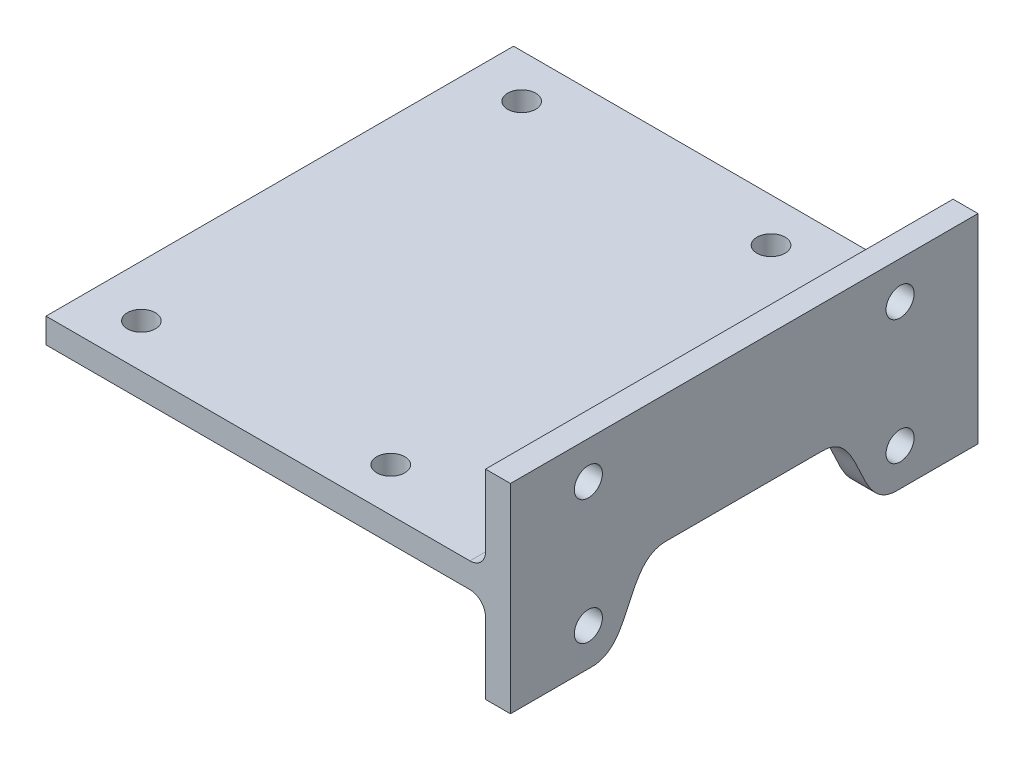
ISO-10303-21;
HEADER;
FILE_DESCRIPTION(('STEP AP214'),'2;1');
FILE_NAME('part.step','',(''),(''),'','','');
FILE_SCHEMA(('AUTOMOTIVE_DESIGN { 1 0 10303 214 1 1 1 1 }'));
ENDSEC;
DATA;
#1=APPLICATION_CONTEXT('core data for automotive mechanical design processes');
#2=APPLICATION_PROTOCOL_DEFINITION('international standard','automotive_design',2000,#1);
#3=PRODUCT_CONTEXT('',#1,'mechanical');
#4=PRODUCT('Part','Part','',(#3));
#5=PRODUCT_RELATED_PRODUCT_CATEGORY('part','',(#4));
#6=PRODUCT_DEFINITION_FORMATION('','',#4);
#7=PRODUCT_DEFINITION_CONTEXT('part definition',#1,'design');
#8=PRODUCT_DEFINITION('design','',#6,#7);
#9=PRODUCT_DEFINITION_SHAPE('','',#8);
#10=(LENGTH_UNIT() NAMED_UNIT(*) SI_UNIT(.MILLI.,.METRE.));
#11=(NAMED_UNIT(*) PLANE_ANGLE_UNIT() SI_UNIT($,.RADIAN.));
#12=(NAMED_UNIT(*) SI_UNIT($,.STERADIAN.) SOLID_ANGLE_UNIT());
#13=UNCERTAINTY_MEASURE_WITH_UNIT(LENGTH_MEASURE(1.E-05),#10,'distance_accuracy_value','');
#14=(GEOMETRIC_REPRESENTATION_CONTEXT(3) GLOBAL_UNCERTAINTY_ASSIGNED_CONTEXT((#13)) GLOBAL_UNIT_ASSIGNED_CONTEXT((#10,
#11,#12)) REPRESENTATION_CONTEXT('',''));
#15=CARTESIAN_POINT('',(0.,0.,0.));
#16=DIRECTION('',(0.,0.,1.));
#17=DIRECTION('',(1.,0.,0.));
#18=AXIS2_PLACEMENT_3D('',#15,#16,#17);
#19=CARTESIAN_POINT('',(141.,0.,150.));
#20=DIRECTION('',(1.,0.,0.));
#21=DIRECTION('',(0.,0.,-1.));
#22=AXIS2_PLACEMENT_3D('',#19,#20,#21);
#23=PLANE('',#22);
#24=CARTESIAN_POINT('',(141.,-16.,25.));
#25=DIRECTION('',(1.,0.,0.));
#26=DIRECTION('',(0.,0.,-1.));
#27=AXIS2_PLACEMENT_3D('',#24,#25,#26);
#28=CIRCLE('',#27,4.5);
#29=CARTESIAN_POINT('',(141.,-16.,20.5));
#30=VERTEX_POINT('',#29);
#31=EDGE_CURVE('E294',#30,#30,#28,.F.);
#32=ORIENTED_EDGE('',*,*,#31,.F.);
#33=EDGE_LOOP('',(#32));
#34=FACE_BOUND('',#33,.T.);
#35=DIRECTION('',(0.,0.,-1.));
#36=VECTOR('',#35,1.);
#37=CARTESIAN_POINT('',(141.,-28.,150.));
#38=LINE('',#37,#36);
#39=CARTESIAN_POINT('',(141.,-28.,26.));
#40=VERTEX_POINT('',#39);
#41=CARTESIAN_POINT('',(141.,-28.,0.));
#42=VERTEX_POINT('',#41);
#43=EDGE_CURVE('E166',#40,#42,#38,.T.);
#44=ORIENTED_EDGE('',*,*,#43,.F.);
#45=CARTESIAN_POINT('',(141.,-5.00000000000001,50.));
#46=CARTESIAN_POINT('',(141.,-5.00000000000001,43.2357435516062));
#47=CARTESIAN_POINT('',(141.,-16.5,38.));
#48=CARTESIAN_POINT('',(141.,-28.,32.7642564483939));
#49=CARTESIAN_POINT('',(141.,-28.,26.));
#50=B_SPLINE_CURVE_WITH_KNOTS('',3,(#45,#46,#47,#48,#49),.UNSPECIFIED.,.F.,.F.,(4,1,4),(0.,0.5,
1.),.UNSPECIFIED.);
#51=CARTESIAN_POINT('',(141.,-5.00000000000001,50.));
#52=VERTEX_POINT('',#51);
#53=EDGE_CURVE('E143',#52,#40,#50,.T.);
#54=ORIENTED_EDGE('',*,*,#53,.F.);
#55=DIRECTION('',(0.,0.,-1.));
#56=VECTOR('',#55,1.);
#57=CARTESIAN_POINT('',(141.,-5.,0.));
#58=LINE('',#57,#56);
#59=CARTESIAN_POINT('',(141.,-5.,0.));
#60=VERTEX_POINT('',#59);
#61=EDGE_CURVE('E175',#52,#60,#58,.T.);
#62=ORIENTED_EDGE('',*,*,#61,.T.);
#63=DIRECTION('',(0.,-1.,0.));
#64=VECTOR('',#63,1.);
#65=CARTESIAN_POINT('',(141.,0.,0.));
#66=LINE('',#65,#64);
#67=EDGE_CURVE('E230',#60,#42,#66,.T.);
#68=ORIENTED_EDGE('',*,*,#67,.T.);
#69=EDGE_LOOP('',(#44,#54,#62,#68));
#70=FACE_BOUND('',#69,.T.);
#71=ADVANCED_FACE('F36',(#34,#70),#23,.F.);
#72=CARTESIAN_POINT('',(0.,-28.,150.));
#73=DIRECTION('',(0.,1.,0.));
#74=DIRECTION('',(0.,0.,1.));
#75=AXIS2_PLACEMENT_3D('',#72,#73,#74);
#76=PLANE('',#75);
#77=DIRECTION('',(-1.,0.,0.));
#78=VECTOR('',#77,1.);
#79=CARTESIAN_POINT('',(149.001,-28.,124.));
#80=LINE('',#79,#78);
#81=CARTESIAN_POINT('',(149.,-28.,124.));
#82=VERTEX_POINT('',#81);
#83=CARTESIAN_POINT('',(141.,-28.,124.));
#84=VERTEX_POINT('',#83);
#85=EDGE_CURVE('E147',#82,#84,#80,.T.);
#86=ORIENTED_EDGE('',*,*,#85,.F.);
#87=DIRECTION('',(0.,0.,-1.));
#88=VECTOR('',#87,1.);
#89=CARTESIAN_POINT('',(149.,-28.,150.));
#90=LINE('',#89,#88);
#91=CARTESIAN_POINT('',(149.,-28.,150.));
#92=VERTEX_POINT('',#91);
#93=EDGE_CURVE('E162',#92,#82,#90,.T.);
#94=ORIENTED_EDGE('',*,*,#93,.F.);
#95=DIRECTION('',(1.,0.,0.));
#96=VECTOR('',#95,1.);
#97=CARTESIAN_POINT('',(0.,-28.,150.));
#98=LINE('',#97,#96);
#99=CARTESIAN_POINT('',(141.,-28.,150.));
#100=VERTEX_POINT('',#99);
#101=EDGE_CURVE('E264',#100,#92,#98,.T.);
#102=ORIENTED_EDGE('',*,*,#101,.F.);
#103=EDGE_CURVE('E172',#100,#84,#38,.T.);
#104=ORIENTED_EDGE('',*,*,#103,.T.);
#105=EDGE_LOOP('',(#86,#94,#102,#104));
#106=FACE_BOUND('',#105,.T.);
#107=ADVANCED_FACE('F280',(#106),#76,.F.);
#108=CARTESIAN_POINT('',(0.,0.,150.));
#109=DIRECTION('',(0.,1.,0.));
#110=DIRECTION('',(0.,0.,1.));
#111=AXIS2_PLACEMENT_3D('',#108,#109,#110);
#112=PLANE('',#111);
#113=CARTESIAN_POINT('',(96.6,0.,14.));
#114=DIRECTION('',(0.,-1.,0.));
#115=DIRECTION('',(0.,0.,-1.));
#116=AXIS2_PLACEMENT_3D('',#113,#114,#115);
#117=CIRCLE('',#116,4.5);
#118=CARTESIAN_POINT('',(96.6,0.,9.49999999999999));
#119=VERTEX_POINT('',#118);
#120=EDGE_CURVE('E325',#119,#119,#117,.T.);
#121=ORIENTED_EDGE('',*,*,#120,.F.);
#122=EDGE_LOOP('',(#121));
#123=FACE_BOUND('',#122,.T.);
#124=CARTESIAN_POINT('',(16.6,0.,14.));
#125=DIRECTION('',(0.,-1.,0.));
#126=DIRECTION('',(0.,0.,-1.));
#127=AXIS2_PLACEMENT_3D('',#124,#125,#126);
#128=CIRCLE('',#127,4.5);
#129=CARTESIAN_POINT('',(16.6,0.,9.5));
#130=VERTEX_POINT('',#129);
#131=EDGE_CURVE('E319',#130,#130,#128,.T.);
#132=ORIENTED_EDGE('',*,*,#131,.F.);
#133=EDGE_LOOP('',(#132));
#134=FACE_BOUND('',#133,.T.);
#135=CARTESIAN_POINT('',(16.6,0.,136.));
#136=DIRECTION('',(0.,-1.,0.));
#137=DIRECTION('',(0.,0.,-1.));
#138=AXIS2_PLACEMENT_3D('',#135,#136,#137);
#139=CIRCLE('',#138,4.50000000000001);
#140=CARTESIAN_POINT('',(16.6,0.,131.5));
#141=VERTEX_POINT('',#140);
#142=EDGE_CURVE('E312',#141,#141,#139,.T.);
#143=ORIENTED_EDGE('',*,*,#142,.F.);
#144=EDGE_LOOP('',(#143));
#145=FACE_BOUND('',#144,.T.);
#146=CARTESIAN_POINT('',(96.6,0.,136.));
#147=DIRECTION('',(0.,-1.,0.));
#148=DIRECTION('',(0.,0.,-1.));
#149=AXIS2_PLACEMENT_3D('',#146,#147,#148);
#150=CIRCLE('',#149,4.50000000000001);
#151=CARTESIAN_POINT('',(96.6,0.,131.5));
#152=VERTEX_POINT('',#151);
#153=EDGE_CURVE('E231',#152,#152,#150,.T.);
#154=ORIENTED_EDGE('',*,*,#153,.F.);
#155=EDGE_LOOP('',(#154));
#156=FACE_BOUND('',#155,.T.);
#157=DIRECTION('',(1.,0.,0.));
#158=VECTOR('',#157,1.);
#159=CARTESIAN_POINT('',(0.,0.,0.));
#160=LINE('',#159,#158);
#161=CARTESIAN_POINT('',(0.,0.,0.));
#162=VERTEX_POINT('',#161);
#163=CARTESIAN_POINT('',(136.,0.,0.));
#164=VERTEX_POINT('',#163);
#165=EDGE_CURVE('E227',#162,#164,#160,.T.);
#166=ORIENTED_EDGE('',*,*,#165,.T.);
#167=DIRECTION('',(0.,0.,-1.));
#168=VECTOR('',#167,1.);
#169=CARTESIAN_POINT('',(136.,0.,150.));
#170=LINE('',#169,#168);
#171=CARTESIAN_POINT('',(136.,0.,150.));
#172=VERTEX_POINT('',#171);
#173=EDGE_CURVE('E179',#164,#172,#170,.F.);
#174=ORIENTED_EDGE('',*,*,#173,.T.);
#175=DIRECTION('',(1.,0.,0.));
#176=VECTOR('',#175,1.);
#177=CARTESIAN_POINT('',(0.,0.,150.));
#178=LINE('',#177,#176);
#179=CARTESIAN_POINT('',(0.,0.,150.));
#180=VERTEX_POINT('',#179);
#181=EDGE_CURVE('E241',#180,#172,#178,.T.);
#182=ORIENTED_EDGE('',*,*,#181,.F.);
#183=DIRECTION('',(0.,0.,-1.));
#184=VECTOR('',#183,1.);
#185=CARTESIAN_POINT('',(0.,0.,150.));
#186=LINE('',#185,#184);
#187=EDGE_CURVE('E221',#180,#162,#186,.T.);
#188=ORIENTED_EDGE('',*,*,#187,.T.);
#189=EDGE_LOOP('',(#166,#174,#182,#188));
#190=FACE_BOUND('',#189,.T.);
#191=ADVANCED_FACE('F250',(#123,#134,#145,#156,#190),#112,.F.);
#192=CARTESIAN_POINT('',(141.,-16.,125.));
#193=DIRECTION('',(1.,0.,0.));
#194=DIRECTION('',(0.,0.,-1.));
#195=AXIS2_PLACEMENT_3D('',#192,#193,#194);
#196=CIRCLE('',#195,4.5);
#197=CARTESIAN_POINT('',(141.,-16.,120.5));
#198=VERTEX_POINT('',#197);
#199=EDGE_CURVE('E298',#198,#198,#196,.F.);
#200=ORIENTED_EDGE('',*,*,#199,.F.);
#201=EDGE_LOOP('',(#200));
#202=FACE_BOUND('',#201,.T.);
#203=CARTESIAN_POINT('',(141.,-5.,150.));
#204=VERTEX_POINT('',#203);
#205=CARTESIAN_POINT('',(141.,-5.,100.));
#206=VERTEX_POINT('',#205);
#207=EDGE_CURVE('E176',#204,#206,#58,.T.);
#208=ORIENTED_EDGE('',*,*,#207,.T.);
#209=CARTESIAN_POINT('',(141.,-28.,124.));
#210=CARTESIAN_POINT('',(141.,-28.,117.235743551606));
#211=CARTESIAN_POINT('',(141.,-16.5,112.));
#212=CARTESIAN_POINT('',(141.,-5.,106.764256448394));
#213=CARTESIAN_POINT('',(141.,-5.,100.));
#214=B_SPLINE_CURVE_WITH_KNOTS('',3,(#209,#210,#211,#212,#213),.UNSPECIFIED.,.F.,.F.,(4,1,4),
(0.,0.5,1.),.UNSPECIFIED.);
#215=EDGE_CURVE('E51',#84,#206,#214,.T.);
#216=ORIENTED_EDGE('',*,*,#215,.F.);
#217=ORIENTED_EDGE('',*,*,#103,.F.);
#218=DIRECTION('',(0.,-1.,0.));
#219=VECTOR('',#218,1.);
#220=CARTESIAN_POINT('',(141.,0.,150.));
#221=LINE('',#220,#219);
#222=EDGE_CURVE('E259',#204,#100,#221,.T.);
#223=ORIENTED_EDGE('',*,*,#222,.F.);
#224=EDGE_LOOP('',(#208,#216,#217,#223));
#225=FACE_BOUND('',#224,.T.);
#226=ADVANCED_FACE('F262',(#202,#225),#23,.F.);
#227=CARTESIAN_POINT('',(149.,-28.,26.));
#228=VERTEX_POINT('',#227);
#229=CARTESIAN_POINT('',(149.,-28.,0.));
#230=VERTEX_POINT('',#229);
#231=EDGE_CURVE('E152',#228,#230,#90,.T.);
#232=ORIENTED_EDGE('',*,*,#231,.F.);
#233=DIRECTION('',(-1.,0.,0.));
#234=VECTOR('',#233,1.);
#235=CARTESIAN_POINT('',(149.001,-28.,26.));
#236=LINE('',#235,#234);
#237=EDGE_CURVE('E137',#228,#40,#236,.T.);
#238=ORIENTED_EDGE('',*,*,#237,.T.);
#239=ORIENTED_EDGE('',*,*,#43,.T.);
#240=DIRECTION('',(1.,0.,0.));
#241=VECTOR('',#240,1.);
#242=CARTESIAN_POINT('',(0.,-28.,0.));
#243=LINE('',#242,#241);
#244=EDGE_CURVE('E160',#42,#230,#243,.T.);
#245=ORIENTED_EDGE('',*,*,#244,.T.);
#246=EDGE_LOOP('',(#232,#238,#239,#245));
#247=FACE_BOUND('',#246,.T.);
#248=ADVANCED_FACE('F158',(#247),#76,.F.);
#249=CARTESIAN_POINT('',(149.,0.,150.));
#250=DIRECTION('',(-1.,0.,0.));
#251=DIRECTION('',(0.,0.,1.));
#252=AXIS2_PLACEMENT_3D('',#249,#250,#251);
#253=PLANE('',#252);
#254=CARTESIAN_POINT('',(149.,-16.,125.));
#255=DIRECTION('',(1.,0.,0.));
#256=DIRECTION('',(0.,0.,-1.));
#257=AXIS2_PLACEMENT_3D('',#254,#255,#256);
#258=CIRCLE('',#257,4.5);
#259=CARTESIAN_POINT('',(149.,-16.,120.5));
#260=VERTEX_POINT('',#259);
#261=EDGE_CURVE('E301',#260,#260,#258,.T.);
#262=ORIENTED_EDGE('',*,*,#261,.F.);
#263=EDGE_LOOP('',(#262));
#264=FACE_BOUND('',#263,.T.);
#265=CARTESIAN_POINT('',(149.,-16.,25.));
#266=DIRECTION('',(1.,0.,0.));
#267=DIRECTION('',(0.,0.,-1.));
#268=AXIS2_PLACEMENT_3D('',#265,#266,#267);
#269=CIRCLE('',#268,4.5);
#270=CARTESIAN_POINT('',(149.,-16.,20.5));
#271=VERTEX_POINT('',#270);
#272=EDGE_CURVE('E295',#271,#271,#269,.T.);
#273=ORIENTED_EDGE('',*,*,#272,.F.);
#274=EDGE_LOOP('',(#273));
#275=FACE_BOUND('',#274,.T.);
#276=CARTESIAN_POINT('',(149.,24.,25.));
#277=DIRECTION('',(1.,0.,0.));
#278=DIRECTION('',(0.,0.,-1.));
#279=AXIS2_PLACEMENT_3D('',#276,#277,#278);
#280=CIRCLE('',#279,4.5);
#281=CARTESIAN_POINT('',(149.,24.,20.5));
#282=VERTEX_POINT('',#281);
#283=EDGE_CURVE('E287',#282,#282,#280,.T.);
#284=ORIENTED_EDGE('',*,*,#283,.F.);
#285=EDGE_LOOP('',(#284));
#286=FACE_BOUND('',#285,.T.);
#287=CARTESIAN_POINT('',(149.,24.,125.));
#288=DIRECTION('',(1.,0.,0.));
#289=DIRECTION('',(0.,0.,-1.));
#290=AXIS2_PLACEMENT_3D('',#287,#288,#289);
#291=CIRCLE('',#290,4.5);
#292=CARTESIAN_POINT('',(149.,24.,120.5));
#293=VERTEX_POINT('',#292);
#294=EDGE_CURVE('E306',#293,#293,#291,.T.);
#295=ORIENTED_EDGE('',*,*,#294,.F.);
#296=EDGE_LOOP('',(#295));
#297=FACE_BOUND('',#296,.T.);
#298=DIRECTION('',(0.,0.,1.));
#299=VECTOR('',#298,1.);
#300=CARTESIAN_POINT('',(149.,-5.00000000000001,50.));
#301=LINE('',#300,#299);
#302=CARTESIAN_POINT('',(149.,-5.00000000000001,50.));
#303=VERTEX_POINT('',#302);
#304=CARTESIAN_POINT('',(149.,-5.,100.));
#305=VERTEX_POINT('',#304);
#306=EDGE_CURVE('E156',#303,#305,#301,.T.);
#307=ORIENTED_EDGE('',*,*,#306,.F.);
#308=CARTESIAN_POINT('',(149.,-5.00000000000001,50.));
#309=CARTESIAN_POINT('',(149.,-5.00000000000001,43.2357435516062));
#310=CARTESIAN_POINT('',(149.,-16.5,38.));
#311=CARTESIAN_POINT('',(149.,-28.,32.7642564483939));
#312=CARTESIAN_POINT('',(149.,-28.,26.));
#313=B_SPLINE_CURVE_WITH_KNOTS('',3,(#308,#309,#310,#311,#312),.UNSPECIFIED.,.F.,.F.,(4,1,4),
(0.,0.5,1.),.UNSPECIFIED.);
#314=EDGE_CURVE('E140',#228,#303,#313,.F.);
#315=ORIENTED_EDGE('',*,*,#314,.F.);
#316=ORIENTED_EDGE('',*,*,#231,.T.);
#317=DIRECTION('',(0.,1.,0.));
#318=VECTOR('',#317,1.);
#319=CARTESIAN_POINT('',(149.,0.,0.));
#320=LINE('',#319,#318);
#321=CARTESIAN_POINT('',(149.,36.,0.));
#322=VERTEX_POINT('',#321);
#323=EDGE_CURVE('E235',#230,#322,#320,.T.);
#324=ORIENTED_EDGE('',*,*,#323,.T.);
#325=DIRECTION('',(0.,0.,-1.));
#326=VECTOR('',#325,1.);
#327=CARTESIAN_POINT('',(149.,36.,150.));
#328=LINE('',#327,#326);
#329=CARTESIAN_POINT('',(149.,36.,150.));
#330=VERTEX_POINT('',#329);
#331=EDGE_CURVE('E163',#330,#322,#328,.T.);
#332=ORIENTED_EDGE('',*,*,#331,.F.);
#333=DIRECTION('',(0.,1.,0.));
#334=VECTOR('',#333,1.);
#335=CARTESIAN_POINT('',(149.,0.,150.));
#336=LINE('',#335,#334);
#337=EDGE_CURVE('E266',#92,#330,#336,.T.);
#338=ORIENTED_EDGE('',*,*,#337,.F.);
#339=ORIENTED_EDGE('',*,*,#93,.T.);
#340=CARTESIAN_POINT('',(149.,-28.,124.));
#341=CARTESIAN_POINT('',(149.,-28.,117.235743551606));
#342=CARTESIAN_POINT('',(149.,-16.5,112.));
#343=CARTESIAN_POINT('',(149.,-5.,106.764256448394));
#344=CARTESIAN_POINT('',(149.,-5.,100.));
#345=B_SPLINE_CURVE_WITH_KNOTS('',3,(#340,#341,#342,#343,#344),.UNSPECIFIED.,.F.,.F.,(4,1,4),
(0.,0.5,1.),.UNSPECIFIED.);
#346=EDGE_CURVE('E277',#305,#82,#345,.F.);
#347=ORIENTED_EDGE('',*,*,#346,.F.);
#348=EDGE_LOOP('',(#307,#315,#316,#324,#332,#338,#339,#347));
#349=FACE_BOUND('',#348,.T.);
#350=ADVANCED_FACE('F151',(#264,#275,#286,#297,#349),#253,.F.);
#351=CARTESIAN_POINT('',(0.,36.,150.));
#352=DIRECTION('',(0.,-1.,0.));
#353=DIRECTION('',(0.,0.,-1.));
#354=AXIS2_PLACEMENT_3D('',#351,#352,#353);
#355=PLANE('',#354);
#356=DIRECTION('',(-1.,0.,0.));
#357=VECTOR('',#356,1.);
#358=CARTESIAN_POINT('',(0.,36.,0.));
#359=LINE('',#358,#357);
#360=CARTESIAN_POINT('',(141.,36.,0.));
#361=VERTEX_POINT('',#360);
#362=EDGE_CURVE('E203',#322,#361,#359,.T.);
#363=ORIENTED_EDGE('',*,*,#362,.T.);
#364=DIRECTION('',(0.,0.,-1.));
#365=VECTOR('',#364,1.);
#366=CARTESIAN_POINT('',(141.,36.,150.));
#367=LINE('',#366,#365);
#368=CARTESIAN_POINT('',(141.,36.,150.));
#369=VERTEX_POINT('',#368);
#370=EDGE_CURVE('E168',#369,#361,#367,.T.);
#371=ORIENTED_EDGE('',*,*,#370,.F.);
#372=DIRECTION('',(-1.,0.,0.));
#373=VECTOR('',#372,1.);
#374=CARTESIAN_POINT('',(0.,36.,150.));
#375=LINE('',#374,#373);
#376=EDGE_CURVE('E223',#330,#369,#375,.T.);
#377=ORIENTED_EDGE('',*,*,#376,.F.);
#378=ORIENTED_EDGE('',*,*,#331,.T.);
#379=EDGE_LOOP('',(#363,#371,#377,#378));
#380=FACE_BOUND('',#379,.T.);
#381=ADVANCED_FACE('F275',(#380),#355,.F.);
#382=CARTESIAN_POINT('',(141.,0.,150.));
#383=DIRECTION('',(-1.,0.,0.));
#384=DIRECTION('',(0.,0.,1.));
#385=AXIS2_PLACEMENT_3D('',#382,#383,#384);
#386=PLANE('',#385);
#387=CARTESIAN_POINT('',(141.,24.,25.));
#388=DIRECTION('',(-1.,0.,0.));
#389=DIRECTION('',(0.,0.,1.));
#390=AXIS2_PLACEMENT_3D('',#387,#388,#389);
#391=CIRCLE('',#390,4.5);
#392=CARTESIAN_POINT('',(141.,24.,29.5));
#393=VERTEX_POINT('',#392);
#394=EDGE_CURVE('E291',#393,#393,#391,.F.);
#395=ORIENTED_EDGE('',*,*,#394,.T.);
#396=EDGE_LOOP('',(#395));
#397=FACE_BOUND('',#396,.T.);
#398=CARTESIAN_POINT('',(141.,24.,125.));
#399=DIRECTION('',(-1.,0.,0.));
#400=DIRECTION('',(0.,0.,1.));
#401=AXIS2_PLACEMENT_3D('',#398,#399,#400);
#402=CIRCLE('',#401,4.5);
#403=CARTESIAN_POINT('',(141.,24.,129.5));
#404=VERTEX_POINT('',#403);
#405=EDGE_CURVE('E290',#404,#404,#402,.F.);
#406=ORIENTED_EDGE('',*,*,#405,.T.);
#407=EDGE_LOOP('',(#406));
#408=FACE_BOUND('',#407,.T.);
#409=DIRECTION('',(0.,1.,0.));
#410=VECTOR('',#409,1.);
#411=CARTESIAN_POINT('',(141.,0.,0.));
#412=LINE('',#411,#410);
#413=CARTESIAN_POINT('',(141.,13.,0.));
#414=VERTEX_POINT('',#413);
#415=EDGE_CURVE('E193',#414,#361,#412,.T.);
#416=ORIENTED_EDGE('',*,*,#415,.F.);
#417=DIRECTION('',(0.,0.,-1.));
#418=VECTOR('',#417,1.);
#419=CARTESIAN_POINT('',(141.,13.,150.));
#420=LINE('',#419,#418);
#421=CARTESIAN_POINT('',(141.,13.,150.));
#422=VERTEX_POINT('',#421);
#423=EDGE_CURVE('E59',#414,#422,#420,.F.);
#424=ORIENTED_EDGE('',*,*,#423,.T.);
#425=DIRECTION('',(0.,1.,0.));
#426=VECTOR('',#425,1.);
#427=CARTESIAN_POINT('',(141.,0.,150.));
#428=LINE('',#427,#426);
#429=EDGE_CURVE('E215',#422,#369,#428,.T.);
#430=ORIENTED_EDGE('',*,*,#429,.T.);
#431=ORIENTED_EDGE('',*,*,#370,.T.);
#432=EDGE_LOOP('',(#416,#424,#430,#431));
#433=FACE_BOUND('',#432,.T.);
#434=ADVANCED_FACE('F200',(#397,#408,#433),#386,.T.);
#435=CARTESIAN_POINT('',(0.,8.,150.));
#436=DIRECTION('',(0.,1.,0.));
#437=DIRECTION('',(0.,0.,1.));
#438=AXIS2_PLACEMENT_3D('',#435,#436,#437);
#439=PLANE('',#438);
#440=CARTESIAN_POINT('',(96.6,8.,14.));
#441=DIRECTION('',(0.,1.,0.));
#442=DIRECTION('',(0.,0.,1.));
#443=AXIS2_PLACEMENT_3D('',#440,#441,#442);
#444=CIRCLE('',#443,4.5);
#445=CARTESIAN_POINT('',(96.6,8.,18.5));
#446=VERTEX_POINT('',#445);
#447=EDGE_CURVE('E309',#446,#446,#444,.F.);
#448=ORIENTED_EDGE('',*,*,#447,.T.);
#449=EDGE_LOOP('',(#448));
#450=FACE_BOUND('',#449,.T.);
#451=CARTESIAN_POINT('',(16.6,8.,14.));
#452=DIRECTION('',(0.,1.,0.));
#453=DIRECTION('',(0.,0.,1.));
#454=AXIS2_PLACEMENT_3D('',#451,#452,#453);
#455=CIRCLE('',#454,4.5);
#456=CARTESIAN_POINT('',(16.6,8.,18.5));
#457=VERTEX_POINT('',#456);
#458=EDGE_CURVE('E322',#457,#457,#455,.F.);
#459=ORIENTED_EDGE('',*,*,#458,.T.);
#460=EDGE_LOOP('',(#459));
#461=FACE_BOUND('',#460,.T.);
#462=CARTESIAN_POINT('',(16.6,8.,136.));
#463=DIRECTION('',(0.,1.,0.));
#464=DIRECTION('',(0.,0.,1.));
#465=AXIS2_PLACEMENT_3D('',#462,#463,#464);
#466=CIRCLE('',#465,4.50000000000001);
#467=CARTESIAN_POINT('',(16.6,8.,140.5));
#468=VERTEX_POINT('',#467);
#469=EDGE_CURVE('E316',#468,#468,#466,.F.);
#470=ORIENTED_EDGE('',*,*,#469,.T.);
#471=EDGE_LOOP('',(#470));
#472=FACE_BOUND('',#471,.T.);
#473=CARTESIAN_POINT('',(96.6,8.,136.));
#474=DIRECTION('',(0.,1.,0.));
#475=DIRECTION('',(0.,0.,1.));
#476=AXIS2_PLACEMENT_3D('',#473,#474,#475);
#477=CIRCLE('',#476,4.50000000000001);
#478=CARTESIAN_POINT('',(96.6,8.,140.5));
#479=VERTEX_POINT('',#478);
#480=EDGE_CURVE('E315',#479,#479,#477,.F.);
#481=ORIENTED_EDGE('',*,*,#480,.T.);
#482=EDGE_LOOP('',(#481));
#483=FACE_BOUND('',#482,.T.);
#484=DIRECTION('',(1.,0.,0.));
#485=VECTOR('',#484,1.);
#486=CARTESIAN_POINT('',(0.,8.,150.));
#487=LINE('',#486,#485);
#488=CARTESIAN_POINT('',(0.,8.,150.));
#489=VERTEX_POINT('',#488);
#490=CARTESIAN_POINT('',(136.,8.,150.));
#491=VERTEX_POINT('',#490);
#492=EDGE_CURVE('E212',#489,#491,#487,.T.);
#493=ORIENTED_EDGE('',*,*,#492,.T.);
#494=DIRECTION('',(0.,0.,-1.));
#495=VECTOR('',#494,1.);
#496=CARTESIAN_POINT('',(136.,8.,0.));
#497=LINE('',#496,#495);
#498=CARTESIAN_POINT('',(136.,8.,0.));
#499=VERTEX_POINT('',#498);
#500=EDGE_CURVE('E181',#491,#499,#497,.T.);
#501=ORIENTED_EDGE('',*,*,#500,.T.);
#502=DIRECTION('',(1.,0.,0.));
#503=VECTOR('',#502,1.);
#504=CARTESIAN_POINT('',(0.,8.,0.));
#505=LINE('',#504,#503);
#506=CARTESIAN_POINT('',(0.,8.,0.));
#507=VERTEX_POINT('',#506);
#508=EDGE_CURVE('E197',#507,#499,#505,.T.);
#509=ORIENTED_EDGE('',*,*,#508,.F.);
#510=DIRECTION('',(0.,0.,-1.));
#511=VECTOR('',#510,1.);
#512=CARTESIAN_POINT('',(0.,8.,150.));
#513=LINE('',#512,#511);
#514=EDGE_CURVE('E218',#489,#507,#513,.T.);
#515=ORIENTED_EDGE('',*,*,#514,.F.);
#516=EDGE_LOOP('',(#493,#501,#509,#515));
#517=FACE_BOUND('',#516,.T.);
#518=ADVANCED_FACE('F217',(#450,#461,#472,#483,#517),#439,.T.);
#519=CARTESIAN_POINT('',(0.,0.,150.));
#520=DIRECTION('',(-1.,0.,0.));
#521=DIRECTION('',(0.,0.,1.));
#522=AXIS2_PLACEMENT_3D('',#519,#520,#521);
#523=PLANE('',#522);
#524=DIRECTION('',(0.,1.,0.));
#525=VECTOR('',#524,1.);
#526=CARTESIAN_POINT('',(0.,0.,0.));
#527=LINE('',#526,#525);
#528=EDGE_CURVE('E239',#162,#507,#527,.T.);
#529=ORIENTED_EDGE('',*,*,#528,.F.);
#530=ORIENTED_EDGE('',*,*,#187,.F.);
#531=DIRECTION('',(0.,1.,0.));
#532=VECTOR('',#531,1.);
#533=CARTESIAN_POINT('',(0.,0.,150.));
#534=LINE('',#533,#532);
#535=EDGE_CURVE('E219',#180,#489,#534,.T.);
#536=ORIENTED_EDGE('',*,*,#535,.T.);
#537=ORIENTED_EDGE('',*,*,#514,.T.);
#538=EDGE_LOOP('',(#529,#530,#536,#537));
#539=FACE_BOUND('',#538,.T.);
#540=ADVANCED_FACE('F245',(#539),#523,.T.);
#541=CARTESIAN_POINT('',(0.,0.,150.));
#542=DIRECTION('',(0.,0.,1.));
#543=DIRECTION('',(1.,0.,0.));
#544=AXIS2_PLACEMENT_3D('',#541,#542,#543);
#545=PLANE('',#544);
#546=ORIENTED_EDGE('',*,*,#181,.T.);
#547=CARTESIAN_POINT('',(136.,-5.,150.));
#548=DIRECTION('',(0.,0.,1.));
#549=DIRECTION('',(1.,0.,0.));
#550=AXIS2_PLACEMENT_3D('',#547,#548,#549);
#551=CIRCLE('',#550,5.);
#552=EDGE_CURVE('E187',#172,#204,#551,.F.);
#553=ORIENTED_EDGE('',*,*,#552,.T.);
#554=ORIENTED_EDGE('',*,*,#222,.T.);
#555=ORIENTED_EDGE('',*,*,#101,.T.);
#556=ORIENTED_EDGE('',*,*,#337,.T.);
#557=ORIENTED_EDGE('',*,*,#376,.T.);
#558=ORIENTED_EDGE('',*,*,#429,.F.);
#559=CARTESIAN_POINT('',(136.,13.,150.));
#560=DIRECTION('',(0.,0.,1.));
#561=DIRECTION('',(1.,0.,0.));
#562=AXIS2_PLACEMENT_3D('',#559,#560,#561);
#563=CIRCLE('',#562,5.);
#564=EDGE_CURVE('E11',#422,#491,#563,.F.);
#565=ORIENTED_EDGE('',*,*,#564,.T.);
#566=ORIENTED_EDGE('',*,*,#492,.F.);
#567=ORIENTED_EDGE('',*,*,#535,.F.);
#568=EDGE_LOOP('',(#546,#553,#554,#555,#556,#557,#558,#565,#566,#567));
#569=FACE_BOUND('',#568,.T.);
#570=ADVANCED_FACE('F210',(#569),#545,.T.);
#571=CARTESIAN_POINT('',(0.,0.,0.));
#572=DIRECTION('',(0.,0.,1.));
#573=DIRECTION('',(1.,0.,0.));
#574=AXIS2_PLACEMENT_3D('',#571,#572,#573);
#575=PLANE('',#574);
#576=ORIENTED_EDGE('',*,*,#165,.F.);
#577=ORIENTED_EDGE('',*,*,#528,.T.);
#578=ORIENTED_EDGE('',*,*,#508,.T.);
#579=CARTESIAN_POINT('',(136.,13.,0.));
#580=DIRECTION('',(0.,0.,1.));
#581=DIRECTION('',(1.,0.,0.));
#582=AXIS2_PLACEMENT_3D('',#579,#580,#581);
#583=CIRCLE('',#582,5.);
#584=EDGE_CURVE('E44',#499,#414,#583,.T.);
#585=ORIENTED_EDGE('',*,*,#584,.T.);
#586=ORIENTED_EDGE('',*,*,#415,.T.);
#587=ORIENTED_EDGE('',*,*,#362,.F.);
#588=ORIENTED_EDGE('',*,*,#323,.F.);
#589=ORIENTED_EDGE('',*,*,#244,.F.);
#590=ORIENTED_EDGE('',*,*,#67,.F.);
#591=CARTESIAN_POINT('',(136.,-5.,0.));
#592=DIRECTION('',(0.,0.,1.));
#593=DIRECTION('',(1.,0.,0.));
#594=AXIS2_PLACEMENT_3D('',#591,#592,#593);
#595=CIRCLE('',#594,5.);
#596=EDGE_CURVE('E185',#60,#164,#595,.T.);
#597=ORIENTED_EDGE('',*,*,#596,.T.);
#598=EDGE_LOOP('',(#576,#577,#578,#585,#586,#587,#588,#589,#590,#597));
#599=FACE_BOUND('',#598,.T.);
#600=ADVANCED_FACE('F191',(#599),#575,.F.);
#601=CARTESIAN_POINT('',(96.6,36.001,136.));
#602=DIRECTION('',(0.,-1.,0.));
#603=DIRECTION('',(0.,0.,-1.));
#604=AXIS2_PLACEMENT_3D('',#601,#602,#603);
#605=CYLINDRICAL_SURFACE('',#604,4.50000000000001);
#606=ORIENTED_EDGE('',*,*,#480,.F.);
#607=EDGE_LOOP('',(#606));
#608=FACE_BOUND('',#607,.T.);
#609=ORIENTED_EDGE('',*,*,#153,.T.);
#610=EDGE_LOOP('',(#609));
#611=FACE_BOUND('',#610,.T.);
#612=ADVANCED_FACE('F335',(#608,#611),#605,.F.);
#613=CARTESIAN_POINT('',(16.6,36.001,136.));
#614=DIRECTION('',(0.,-1.,0.));
#615=DIRECTION('',(0.,0.,-1.));
#616=AXIS2_PLACEMENT_3D('',#613,#614,#615);
#617=CYLINDRICAL_SURFACE('',#616,4.50000000000001);
#618=ORIENTED_EDGE('',*,*,#469,.F.);
#619=EDGE_LOOP('',(#618));
#620=FACE_BOUND('',#619,.T.);
#621=ORIENTED_EDGE('',*,*,#142,.T.);
#622=EDGE_LOOP('',(#621));
#623=FACE_BOUND('',#622,.T.);
#624=ADVANCED_FACE('F338',(#620,#623),#617,.F.);
#625=CARTESIAN_POINT('',(16.6,36.001,14.));
#626=DIRECTION('',(0.,-1.,0.));
#627=DIRECTION('',(0.,0.,-1.));
#628=AXIS2_PLACEMENT_3D('',#625,#626,#627);
#629=CYLINDRICAL_SURFACE('',#628,4.5);
#630=ORIENTED_EDGE('',*,*,#458,.F.);
#631=EDGE_LOOP('',(#630));
#632=FACE_BOUND('',#631,.T.);
#633=ORIENTED_EDGE('',*,*,#131,.T.);
#634=EDGE_LOOP('',(#633));
#635=FACE_BOUND('',#634,.T.);
#636=ADVANCED_FACE('F383',(#632,#635),#629,.F.);
#637=CARTESIAN_POINT('',(96.6,36.001,14.));
#638=DIRECTION('',(0.,-1.,0.));
#639=DIRECTION('',(0.,0.,-1.));
#640=AXIS2_PLACEMENT_3D('',#637,#638,#639);
#641=CYLINDRICAL_SURFACE('',#640,4.5);
#642=ORIENTED_EDGE('',*,*,#447,.F.);
#643=EDGE_LOOP('',(#642));
#644=FACE_BOUND('',#643,.T.);
#645=ORIENTED_EDGE('',*,*,#120,.T.);
#646=EDGE_LOOP('',(#645));
#647=FACE_BOUND('',#646,.T.);
#648=ADVANCED_FACE('F379',(#644,#647),#641,.F.);
#649=CARTESIAN_POINT('',(-0.001000000000001,24.,125.));
#650=DIRECTION('',(1.,0.,0.));
#651=DIRECTION('',(0.,0.,-1.));
#652=AXIS2_PLACEMENT_3D('',#649,#650,#651);
#653=CYLINDRICAL_SURFACE('',#652,4.5);
#654=ORIENTED_EDGE('',*,*,#405,.F.);
#655=EDGE_LOOP('',(#654));
#656=FACE_BOUND('',#655,.T.);
#657=ORIENTED_EDGE('',*,*,#294,.T.);
#658=EDGE_LOOP('',(#657));
#659=FACE_BOUND('',#658,.T.);
#660=ADVANCED_FACE('F382',(#656,#659),#653,.F.);
#661=CARTESIAN_POINT('',(-0.001000000000001,24.,25.));
#662=DIRECTION('',(1.,0.,0.));
#663=DIRECTION('',(0.,0.,-1.));
#664=AXIS2_PLACEMENT_3D('',#661,#662,#663);
#665=CYLINDRICAL_SURFACE('',#664,4.5);
#666=ORIENTED_EDGE('',*,*,#394,.F.);
#667=EDGE_LOOP('',(#666));
#668=FACE_BOUND('',#667,.T.);
#669=ORIENTED_EDGE('',*,*,#283,.T.);
#670=EDGE_LOOP('',(#669));
#671=FACE_BOUND('',#670,.T.);
#672=ADVANCED_FACE('F393',(#668,#671),#665,.F.);
#673=CARTESIAN_POINT('',(-0.001000000000001,-16.,25.));
#674=DIRECTION('',(1.,0.,0.));
#675=DIRECTION('',(0.,0.,-1.));
#676=AXIS2_PLACEMENT_3D('',#673,#674,#675);
#677=CYLINDRICAL_SURFACE('',#676,4.5);
#678=ORIENTED_EDGE('',*,*,#272,.T.);
#679=EDGE_LOOP('',(#678));
#680=FACE_BOUND('',#679,.T.);
#681=ORIENTED_EDGE('',*,*,#31,.T.);
#682=EDGE_LOOP('',(#681));
#683=FACE_BOUND('',#682,.T.);
#684=ADVANCED_FACE('F398',(#680,#683),#677,.F.);
#685=CARTESIAN_POINT('',(-0.001000000000001,-16.,125.));
#686=DIRECTION('',(1.,0.,0.));
#687=DIRECTION('',(0.,0.,-1.));
#688=AXIS2_PLACEMENT_3D('',#685,#686,#687);
#689=CYLINDRICAL_SURFACE('',#688,4.5);
#690=ORIENTED_EDGE('',*,*,#261,.T.);
#691=EDGE_LOOP('',(#690));
#692=FACE_BOUND('',#691,.T.);
#693=ORIENTED_EDGE('',*,*,#199,.T.);
#694=EDGE_LOOP('',(#693));
#695=FACE_BOUND('',#694,.T.);
#696=ADVANCED_FACE('F395',(#692,#695),#689,.F.);
#697=CARTESIAN_POINT('',(136.,-5.,150.));
#698=DIRECTION('',(0.,0.,1.));
#699=DIRECTION('',(1.,0.,0.));
#700=AXIS2_PLACEMENT_3D('',#697,#698,#699);
#701=CYLINDRICAL_SURFACE('',#700,5.);
#702=ORIENTED_EDGE('',*,*,#552,.F.);
#703=ORIENTED_EDGE('',*,*,#173,.F.);
#704=ORIENTED_EDGE('',*,*,#596,.F.);
#705=ORIENTED_EDGE('',*,*,#61,.F.);
#706=DIRECTION('',(0.,0.,-1.));
#707=VECTOR('',#706,1.);
#708=CARTESIAN_POINT('',(141.,-5.00000000000001,50.));
#709=LINE('',#708,#707);
#710=EDGE_CURVE('E148',#206,#52,#709,.T.);
#711=ORIENTED_EDGE('',*,*,#710,.F.);
#712=ORIENTED_EDGE('',*,*,#207,.F.);
#713=EDGE_LOOP('',(#702,#703,#704,#705,#711,#712));
#714=FACE_BOUND('',#713,.T.);
#715=ADVANCED_FACE('F254',(#714),#701,.F.);
#716=CARTESIAN_POINT('',(136.,13.,150.));
#717=DIRECTION('',(0.,0.,1.));
#718=DIRECTION('',(1.,0.,0.));
#719=AXIS2_PLACEMENT_3D('',#716,#717,#718);
#720=CYLINDRICAL_SURFACE('',#719,5.);
#721=ORIENTED_EDGE('',*,*,#564,.F.);
#722=ORIENTED_EDGE('',*,*,#423,.F.);
#723=ORIENTED_EDGE('',*,*,#584,.F.);
#724=ORIENTED_EDGE('',*,*,#500,.F.);
#725=EDGE_LOOP('',(#721,#722,#723,#724));
#726=FACE_BOUND('',#725,.T.);
#727=ADVANCED_FACE('F38',(#726),#720,.F.);
#728=CARTESIAN_POINT('',(149.001,-5.00000000000001,50.));
#729=CARTESIAN_POINT('',(149.001,-5.00000000000001,43.2357435516062));
#730=CARTESIAN_POINT('',(149.001,-16.5,38.));
#731=CARTESIAN_POINT('',(149.001,-28.,32.7642564483939));
#732=CARTESIAN_POINT('',(149.001,-28.,26.));
#733=B_SPLINE_CURVE_WITH_KNOTS('',3,(#728,#729,#730,#731,#732),.UNSPECIFIED.,.F.,.F.,(4,1,4),
(0.,0.5,1.),.UNSPECIFIED.);
#734=DIRECTION('',(-1.,0.,0.));
#735=VECTOR('',#734,1.);
#736=SURFACE_OF_LINEAR_EXTRUSION('',#733,#735);
#737=ORIENTED_EDGE('',*,*,#314,.T.);
#738=DIRECTION('',(-1.,0.,0.));
#739=VECTOR('',#738,1.);
#740=CARTESIAN_POINT('',(149.001,-5.00000000000001,50.));
#741=LINE('',#740,#739);
#742=EDGE_CURVE('E283',#303,#52,#741,.T.);
#743=ORIENTED_EDGE('',*,*,#742,.T.);
#744=ORIENTED_EDGE('',*,*,#53,.T.);
#745=ORIENTED_EDGE('',*,*,#237,.F.);
#746=EDGE_LOOP('',(#737,#743,#744,#745));
#747=FACE_BOUND('',#746,.T.);
#748=ADVANCED_FACE('F139',(#747),#736,.F.);
#749=CARTESIAN_POINT('',(149.001,-5.00000000000001,50.));
#750=DIRECTION('',(0.,1.,0.));
#751=DIRECTION('',(0.,0.,1.));
#752=AXIS2_PLACEMENT_3D('',#749,#750,#751);
#753=PLANE('',#752);
#754=ORIENTED_EDGE('',*,*,#306,.T.);
#755=DIRECTION('',(-1.,0.,0.));
#756=VECTOR('',#755,1.);
#757=CARTESIAN_POINT('',(149.001,-5.,100.));
#758=LINE('',#757,#756);
#759=EDGE_CURVE('E281',#305,#206,#758,.T.);
#760=ORIENTED_EDGE('',*,*,#759,.T.);
#761=ORIENTED_EDGE('',*,*,#710,.T.);
#762=ORIENTED_EDGE('',*,*,#742,.F.);
#763=EDGE_LOOP('',(#754,#760,#761,#762));
#764=FACE_BOUND('',#763,.T.);
#765=ADVANCED_FACE('F409',(#764),#753,.F.);
#766=CARTESIAN_POINT('',(149.001,-28.,124.));
#767=CARTESIAN_POINT('',(149.001,-28.,117.235743551606));
#768=CARTESIAN_POINT('',(149.001,-16.5,112.));
#769=CARTESIAN_POINT('',(149.001,-5.,106.764256448394));
#770=CARTESIAN_POINT('',(149.001,-5.,100.));
#771=B_SPLINE_CURVE_WITH_KNOTS('',3,(#766,#767,#768,#769,#770),.UNSPECIFIED.,.F.,.F.,(4,1,4),
(0.,0.5,1.),.UNSPECIFIED.);
#772=DIRECTION('',(-1.,0.,0.));
#773=VECTOR('',#772,1.);
#774=SURFACE_OF_LINEAR_EXTRUSION('',#771,#773);
#775=ORIENTED_EDGE('',*,*,#346,.T.);
#776=ORIENTED_EDGE('',*,*,#85,.T.);
#777=ORIENTED_EDGE('',*,*,#215,.T.);
#778=ORIENTED_EDGE('',*,*,#759,.F.);
#779=EDGE_LOOP('',(#775,#776,#777,#778));
#780=FACE_BOUND('',#779,.T.);
#781=ADVANCED_FACE('F410',(#780),#774,.F.);
#782=CLOSED_SHELL('',(#71,#107,#191,#226,#248,#350,#381,#434,#518,#540,#570,#600,#612,#624,#636,
#648,#660,#672,#684,#696,#715,#727,#748,#765,#781));
#783=MANIFOLD_SOLID_BREP('B2',#782);
#784=ADVANCED_BREP_SHAPE_REPRESENTATION('',(#18,#783),#14);
#785=SHAPE_DEFINITION_REPRESENTATION(#9,#784);
ENDSEC;
END-ISO-10303-21;
